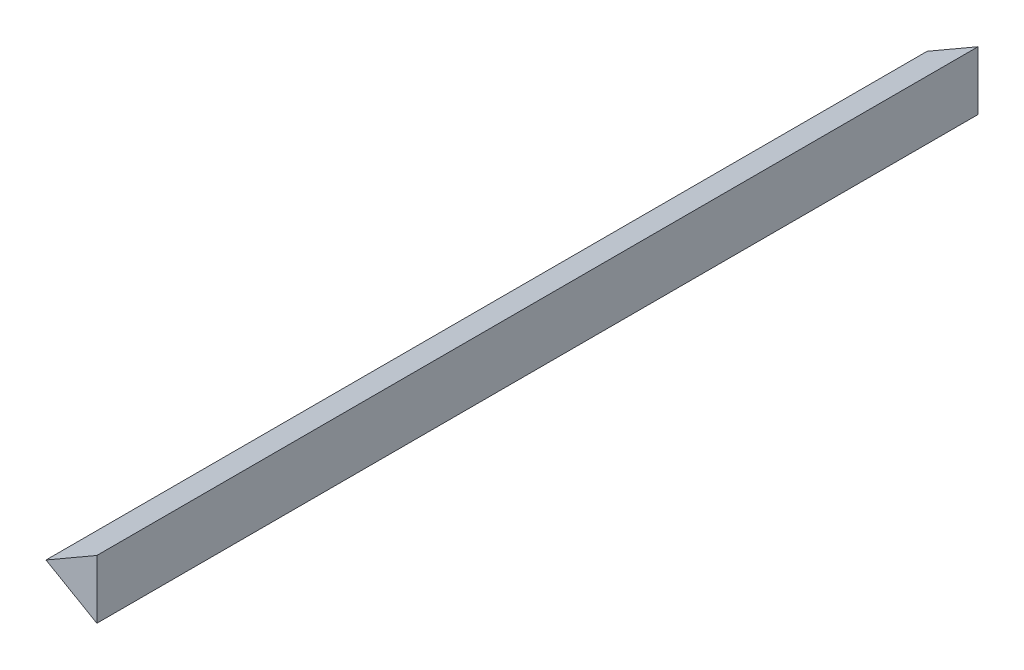
ISO-10303-21;
HEADER;
FILE_DESCRIPTION(('STEP AP214'),'2;1');
FILE_NAME('part.step','',(''),(''),'','','');
FILE_SCHEMA(('AUTOMOTIVE_DESIGN { 1 0 10303 214 1 1 1 1 }'));
ENDSEC;
DATA;
#1=APPLICATION_CONTEXT('core data for automotive mechanical design processes');
#2=APPLICATION_PROTOCOL_DEFINITION('international standard','automotive_design',2000,#1);
#3=PRODUCT_CONTEXT('',#1,'mechanical');
#4=PRODUCT('Part','Part','',(#3));
#5=PRODUCT_RELATED_PRODUCT_CATEGORY('part','',(#4));
#6=PRODUCT_DEFINITION_FORMATION('','',#4);
#7=PRODUCT_DEFINITION_CONTEXT('part definition',#1,'design');
#8=PRODUCT_DEFINITION('design','',#6,#7);
#9=PRODUCT_DEFINITION_SHAPE('','',#8);
#10=(LENGTH_UNIT() NAMED_UNIT(*) SI_UNIT(.MILLI.,.METRE.));
#11=(NAMED_UNIT(*) PLANE_ANGLE_UNIT() SI_UNIT($,.RADIAN.));
#12=(NAMED_UNIT(*) SI_UNIT($,.STERADIAN.) SOLID_ANGLE_UNIT());
#13=UNCERTAINTY_MEASURE_WITH_UNIT(LENGTH_MEASURE(1.E-05),#10,'distance_accuracy_value','');
#14=(GEOMETRIC_REPRESENTATION_CONTEXT(3) GLOBAL_UNCERTAINTY_ASSIGNED_CONTEXT((#13)) GLOBAL_UNIT_ASSIGNED_CONTEXT((#10,
#11,#12)) REPRESENTATION_CONTEXT('',''));
#15=CARTESIAN_POINT('',(0.,0.,0.));
#16=DIRECTION('',(0.,0.,1.));
#17=DIRECTION('',(1.,0.,0.));
#18=AXIS2_PLACEMENT_3D('',#15,#16,#17);
#19=CARTESIAN_POINT('',(120.,140.,-600.));
#20=DIRECTION('',(-0.5,-0.866025403784438,0.));
#21=DIRECTION('',(0.866025403784439,-0.5,0.));
#22=AXIS2_PLACEMENT_3D('',#19,#20,#21);
#23=PLANE('',#22);
#24=DIRECTION('',(0.866025403784438,-0.5,0.));
#25=VECTOR('',#24,1.);
#26=CARTESIAN_POINT('',(120.,140.,0.));
#27=LINE('',#26,#25);
#28=CARTESIAN_POINT('',(120.,140.,0.));
#29=VERTEX_POINT('',#28);
#30=CARTESIAN_POINT('',(154.641016151378,120.,0.));
#31=VERTEX_POINT('',#30);
#32=EDGE_CURVE('E91',#29,#31,#27,.T.);
#33=ORIENTED_EDGE('',*,*,#32,.F.);
#34=DIRECTION('',(0.,0.,1.));
#35=VECTOR('',#34,1.);
#36=CARTESIAN_POINT('',(120.,140.,-600.));
#37=LINE('',#36,#35);
#38=CARTESIAN_POINT('',(120.,140.,-600.));
#39=VERTEX_POINT('',#38);
#40=EDGE_CURVE('E11',#39,#29,#37,.T.);
#41=ORIENTED_EDGE('',*,*,#40,.F.);
#42=DIRECTION('',(0.866025403784438,-0.5,0.));
#43=VECTOR('',#42,1.);
#44=CARTESIAN_POINT('',(120.,140.,-600.));
#45=LINE('',#44,#43);
#46=CARTESIAN_POINT('',(154.641016151378,120.,-600.));
#47=VERTEX_POINT('',#46);
#48=EDGE_CURVE('E83',#39,#47,#45,.T.);
#49=ORIENTED_EDGE('',*,*,#48,.T.);
#50=DIRECTION('',(0.,0.,1.));
#51=VECTOR('',#50,1.);
#52=CARTESIAN_POINT('',(154.641016151378,120.,-600.));
#53=LINE('',#52,#51);
#54=EDGE_CURVE('E42',#47,#31,#53,.T.);
#55=ORIENTED_EDGE('',*,*,#54,.T.);
#56=EDGE_LOOP('',(#33,#41,#49,#55));
#57=FACE_BOUND('',#56,.T.);
#58=ADVANCED_FACE('F39',(#57),#23,.T.);
#59=CARTESIAN_POINT('',(120.,140.,-600.));
#60=DIRECTION('',(-0.5,0.866025403784439,0.));
#61=DIRECTION('',(-0.866025403784439,-0.5,0.));
#62=AXIS2_PLACEMENT_3D('',#59,#60,#61);
#63=PLANE('',#62);
#64=DIRECTION('',(-0.866025403784439,-0.5,0.));
#65=VECTOR('',#64,1.);
#66=CARTESIAN_POINT('',(120.,140.,0.));
#67=LINE('',#66,#65);
#68=CARTESIAN_POINT('',(154.641016151378,160.,0.));
#69=VERTEX_POINT('',#68);
#70=EDGE_CURVE('E85',#69,#29,#67,.T.);
#71=ORIENTED_EDGE('',*,*,#70,.F.);
#72=DIRECTION('',(0.,0.,1.));
#73=VECTOR('',#72,1.);
#74=CARTESIAN_POINT('',(154.641016151378,160.,-600.));
#75=LINE('',#74,#73);
#76=CARTESIAN_POINT('',(154.641016151378,160.,-600.));
#77=VERTEX_POINT('',#76);
#78=EDGE_CURVE('E48',#77,#69,#75,.T.);
#79=ORIENTED_EDGE('',*,*,#78,.F.);
#80=DIRECTION('',(-0.866025403784439,-0.5,0.));
#81=VECTOR('',#80,1.);
#82=CARTESIAN_POINT('',(120.,140.,-600.));
#83=LINE('',#82,#81);
#84=EDGE_CURVE('E80',#77,#39,#83,.T.);
#85=ORIENTED_EDGE('',*,*,#84,.T.);
#86=ORIENTED_EDGE('',*,*,#40,.T.);
#87=EDGE_LOOP('',(#71,#79,#85,#86));
#88=FACE_BOUND('',#87,.T.);
#89=ADVANCED_FACE('F95',(#88),#63,.T.);
#90=CARTESIAN_POINT('',(154.641016151378,120.,-600.));
#91=DIRECTION('',(1.,0.,0.));
#92=DIRECTION('',(0.,0.,-1.));
#93=AXIS2_PLACEMENT_3D('',#90,#91,#92);
#94=PLANE('',#93);
#95=DIRECTION('',(0.,1.,0.));
#96=VECTOR('',#95,1.);
#97=CARTESIAN_POINT('',(154.641016151378,120.,0.));
#98=LINE('',#97,#96);
#99=EDGE_CURVE('E78',#31,#69,#98,.T.);
#100=ORIENTED_EDGE('',*,*,#99,.F.);
#101=ORIENTED_EDGE('',*,*,#54,.F.);
#102=DIRECTION('',(0.,1.,0.));
#103=VECTOR('',#102,1.);
#104=CARTESIAN_POINT('',(154.641016151378,120.,-600.));
#105=LINE('',#104,#103);
#106=EDGE_CURVE('E76',#47,#77,#105,.T.);
#107=ORIENTED_EDGE('',*,*,#106,.T.);
#108=ORIENTED_EDGE('',*,*,#78,.T.);
#109=EDGE_LOOP('',(#100,#101,#107,#108));
#110=FACE_BOUND('',#109,.T.);
#111=ADVANCED_FACE('F75',(#110),#94,.T.);
#112=CARTESIAN_POINT('',(0.,0.,-600.));
#113=DIRECTION('',(0.,0.,1.));
#114=DIRECTION('',(1.,0.,0.));
#115=AXIS2_PLACEMENT_3D('',#112,#113,#114);
#116=PLANE('',#115);
#117=ORIENTED_EDGE('',*,*,#48,.F.);
#118=ORIENTED_EDGE('',*,*,#84,.F.);
#119=ORIENTED_EDGE('',*,*,#106,.F.);
#120=EDGE_LOOP('',(#117,#118,#119));
#121=FACE_BOUND('',#120,.T.);
#122=ADVANCED_FACE('F82',(#121),#116,.F.);
#123=CARTESIAN_POINT('',(0.,0.,0.));
#124=DIRECTION('',(0.,0.,1.));
#125=DIRECTION('',(1.,0.,0.));
#126=AXIS2_PLACEMENT_3D('',#123,#124,#125);
#127=PLANE('',#126);
#128=ORIENTED_EDGE('',*,*,#32,.T.);
#129=ORIENTED_EDGE('',*,*,#99,.T.);
#130=ORIENTED_EDGE('',*,*,#70,.T.);
#131=EDGE_LOOP('',(#128,#129,#130));
#132=FACE_BOUND('',#131,.T.);
#133=ADVANCED_FACE('F94',(#132),#127,.T.);
#134=CLOSED_SHELL('',(#58,#89,#111,#122,#133));
#135=MANIFOLD_SOLID_BREP('B2',#134);
#136=ADVANCED_BREP_SHAPE_REPRESENTATION('',(#18,#135),#14);
#137=SHAPE_DEFINITION_REPRESENTATION(#9,#136);
ENDSEC;
END-ISO-10303-21;
